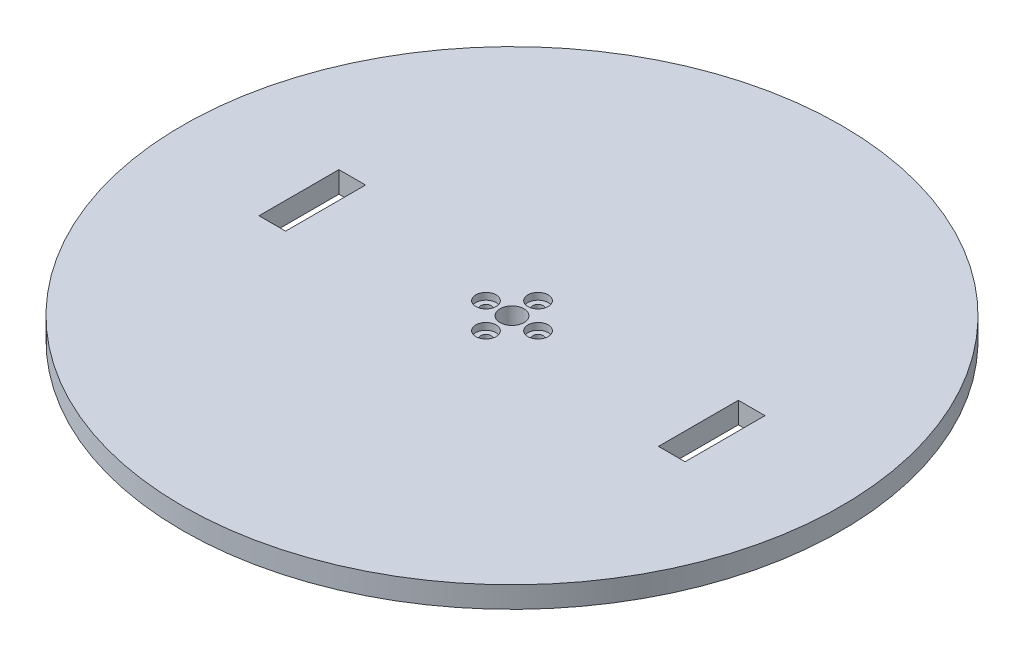
ISO-10303-21;
HEADER;
FILE_DESCRIPTION(('STEP AP214'),'2;1');
FILE_NAME('part.step','',(''),(''),'','','');
FILE_SCHEMA(('AUTOMOTIVE_DESIGN { 1 0 10303 214 1 1 1 1 }'));
ENDSEC;
DATA;
#1=APPLICATION_CONTEXT('core data for automotive mechanical design processes');
#2=APPLICATION_PROTOCOL_DEFINITION('international standard','automotive_design',2000,#1);
#3=PRODUCT_CONTEXT('',#1,'mechanical');
#4=PRODUCT('Part','Part','',(#3));
#5=PRODUCT_RELATED_PRODUCT_CATEGORY('part','',(#4));
#6=PRODUCT_DEFINITION_FORMATION('','',#4);
#7=PRODUCT_DEFINITION_CONTEXT('part definition',#1,'design');
#8=PRODUCT_DEFINITION('design','',#6,#7);
#9=PRODUCT_DEFINITION_SHAPE('','',#8);
#10=(LENGTH_UNIT() NAMED_UNIT(*) SI_UNIT(.MILLI.,.METRE.));
#11=(NAMED_UNIT(*) PLANE_ANGLE_UNIT() SI_UNIT($,.RADIAN.));
#12=(NAMED_UNIT(*) SI_UNIT($,.STERADIAN.) SOLID_ANGLE_UNIT());
#13=UNCERTAINTY_MEASURE_WITH_UNIT(LENGTH_MEASURE(1.E-05),#10,'distance_accuracy_value','');
#14=(GEOMETRIC_REPRESENTATION_CONTEXT(3) GLOBAL_UNCERTAINTY_ASSIGNED_CONTEXT((#13)) GLOBAL_UNIT_ASSIGNED_CONTEXT((#10,
#11,#12)) REPRESENTATION_CONTEXT('',''));
#15=CARTESIAN_POINT('',(0.,0.,0.));
#16=DIRECTION('',(0.,0.,1.));
#17=DIRECTION('',(1.,0.,0.));
#18=AXIS2_PLACEMENT_3D('',#15,#16,#17);
#19=CARTESIAN_POINT('',(-9.779,0.,-1.02429588037641E-13));
#20=DIRECTION('',(0.,1.,0.));
#21=DIRECTION('',(0.,0.,1.));
#22=AXIS2_PLACEMENT_3D('',#19,#20,#21);
#23=CYLINDRICAL_SURFACE('',#22,1.905);
#24=CARTESIAN_POINT('',(-9.779,0.,-1.02429588037641E-13));
#25=DIRECTION('',(0.,1.,0.));
#26=DIRECTION('',(1.,0.,0.));
#27=AXIS2_PLACEMENT_3D('',#24,#25,#26);
#28=CIRCLE('',#27,1.905);
#29=CARTESIAN_POINT('',(-7.874,0.,0.));
#30=VERTEX_POINT('',#29);
#31=EDGE_CURVE('E240',#30,#30,#28,.T.);
#32=ORIENTED_EDGE('',*,*,#31,.F.);
#33=EDGE_LOOP('',(#32));
#34=FACE_BOUND('',#33,.T.);
#35=CARTESIAN_POINT('',(-9.779,5.46,-1.02429588037641E-13));
#36=DIRECTION('',(0.,1.,0.));
#37=DIRECTION('',(0.,0.,1.));
#38=AXIS2_PLACEMENT_3D('',#35,#36,#37);
#39=CIRCLE('',#38,1.905);
#40=CARTESIAN_POINT('',(-9.779,5.46,1.9049999999999));
#41=VERTEX_POINT('',#40);
#42=EDGE_CURVE('E45',#41,#41,#39,.F.);
#43=ORIENTED_EDGE('',*,*,#42,.F.);
#44=EDGE_LOOP('',(#43));
#45=FACE_BOUND('',#44,.T.);
#46=ADVANCED_FACE('F41',(#34,#45),#23,.F.);
#47=CARTESIAN_POINT('',(0.,0.,9.779));
#48=DIRECTION('',(0.,1.,0.));
#49=DIRECTION('',(0.,0.,1.));
#50=AXIS2_PLACEMENT_3D('',#47,#48,#49);
#51=CYLINDRICAL_SURFACE('',#50,1.905);
#52=CARTESIAN_POINT('',(0.,0.,9.779));
#53=DIRECTION('',(0.,1.,0.));
#54=DIRECTION('',(0.,0.,-1.));
#55=AXIS2_PLACEMENT_3D('',#52,#53,#54);
#56=CIRCLE('',#55,1.905);
#57=CARTESIAN_POINT('',(0.,0.,7.874));
#58=VERTEX_POINT('',#57);
#59=EDGE_CURVE('E250',#58,#58,#56,.T.);
#60=ORIENTED_EDGE('',*,*,#59,.F.);
#61=EDGE_LOOP('',(#60));
#62=FACE_BOUND('',#61,.T.);
#63=CARTESIAN_POINT('',(0.,5.46,9.779));
#64=DIRECTION('',(0.,1.,0.));
#65=DIRECTION('',(0.,0.,1.));
#66=AXIS2_PLACEMENT_3D('',#63,#64,#65);
#67=CIRCLE('',#66,1.905);
#68=CARTESIAN_POINT('',(0.,5.46,11.684));
#69=VERTEX_POINT('',#68);
#70=EDGE_CURVE('E268',#69,#69,#67,.F.);
#71=ORIENTED_EDGE('',*,*,#70,.F.);
#72=EDGE_LOOP('',(#71));
#73=FACE_BOUND('',#72,.T.);
#74=ADVANCED_FACE('F280',(#62,#73),#51,.F.);
#75=CARTESIAN_POINT('',(9.779,0.,0.));
#76=DIRECTION('',(0.,1.,0.));
#77=DIRECTION('',(0.,0.,1.));
#78=AXIS2_PLACEMENT_3D('',#75,#76,#77);
#79=CYLINDRICAL_SURFACE('',#78,1.905);
#80=CARTESIAN_POINT('',(9.779,0.,0.));
#81=DIRECTION('',(0.,1.,0.));
#82=DIRECTION('',(-1.,0.,0.));
#83=AXIS2_PLACEMENT_3D('',#80,#81,#82);
#84=CIRCLE('',#83,1.905);
#85=CARTESIAN_POINT('',(7.874,0.,0.));
#86=VERTEX_POINT('',#85);
#87=EDGE_CURVE('E245',#86,#86,#84,.T.);
#88=ORIENTED_EDGE('',*,*,#87,.F.);
#89=EDGE_LOOP('',(#88));
#90=FACE_BOUND('',#89,.T.);
#91=CARTESIAN_POINT('',(9.779,5.46,0.));
#92=DIRECTION('',(0.,1.,0.));
#93=DIRECTION('',(0.,0.,1.));
#94=AXIS2_PLACEMENT_3D('',#91,#92,#93);
#95=CIRCLE('',#94,1.905);
#96=CARTESIAN_POINT('',(9.779,5.46,1.90500000000003));
#97=VERTEX_POINT('',#96);
#98=EDGE_CURVE('E207',#97,#97,#95,.F.);
#99=ORIENTED_EDGE('',*,*,#98,.F.);
#100=EDGE_LOOP('',(#99));
#101=FACE_BOUND('',#100,.T.);
#102=ADVANCED_FACE('F286',(#90,#101),#79,.F.);
#103=CARTESIAN_POINT('',(0.,0.,-9.779));
#104=DIRECTION('',(0.,1.,0.));
#105=DIRECTION('',(0.,0.,1.));
#106=AXIS2_PLACEMENT_3D('',#103,#104,#105);
#107=CYLINDRICAL_SURFACE('',#106,1.905);
#108=CARTESIAN_POINT('',(0.,0.,-9.779));
#109=DIRECTION('',(0.,1.,0.));
#110=DIRECTION('',(0.,0.,1.));
#111=AXIS2_PLACEMENT_3D('',#108,#109,#110);
#112=CIRCLE('',#111,1.905);
#113=CARTESIAN_POINT('',(0.,0.,-7.874));
#114=VERTEX_POINT('',#113);
#115=EDGE_CURVE('E249',#114,#114,#112,.T.);
#116=ORIENTED_EDGE('',*,*,#115,.F.);
#117=EDGE_LOOP('',(#116));
#118=FACE_BOUND('',#117,.T.);
#119=CARTESIAN_POINT('',(0.,5.46,-9.779));
#120=DIRECTION('',(0.,1.,0.));
#121=DIRECTION('',(0.,0.,1.));
#122=AXIS2_PLACEMENT_3D('',#119,#120,#121);
#123=CIRCLE('',#122,1.905);
#124=CARTESIAN_POINT('',(0.,5.46,-7.874));
#125=VERTEX_POINT('',#124);
#126=EDGE_CURVE('E231',#125,#125,#123,.F.);
#127=ORIENTED_EDGE('',*,*,#126,.F.);
#128=EDGE_LOOP('',(#127));
#129=FACE_BOUND('',#128,.T.);
#130=ADVANCED_FACE('F292',(#118,#129),#107,.F.);
#131=CARTESIAN_POINT('',(0.,8.,0.));
#132=DIRECTION('',(0.,-1.,0.));
#133=DIRECTION('',(0.,0.,-1.));
#134=AXIS2_PLACEMENT_3D('',#131,#132,#133);
#135=CYLINDRICAL_SURFACE('',#134,123.75);
#136=CARTESIAN_POINT('',(0.,8.,0.));
#137=DIRECTION('',(0.,1.,0.));
#138=DIRECTION('',(0.,0.,1.));
#139=AXIS2_PLACEMENT_3D('',#136,#137,#138);
#140=CIRCLE('',#139,123.75);
#141=CARTESIAN_POINT('',(0.,8.,123.75));
#142=VERTEX_POINT('',#141);
#143=EDGE_CURVE('E11',#142,#142,#140,.T.);
#144=ORIENTED_EDGE('',*,*,#143,.F.);
#145=EDGE_LOOP('',(#144));
#146=FACE_BOUND('',#145,.T.);
#147=CARTESIAN_POINT('',(0.,0.,0.));
#148=DIRECTION('',(0.,1.,0.));
#149=DIRECTION('',(0.,0.,1.));
#150=AXIS2_PLACEMENT_3D('',#147,#148,#149);
#151=CIRCLE('',#150,123.75);
#152=CARTESIAN_POINT('',(0.,0.,123.75));
#153=VERTEX_POINT('',#152);
#154=EDGE_CURVE('E51',#153,#153,#151,.T.);
#155=ORIENTED_EDGE('',*,*,#154,.T.);
#156=EDGE_LOOP('',(#155));
#157=FACE_BOUND('',#156,.T.);
#158=ADVANCED_FACE('F43',(#146,#157),#135,.T.);
#159=CARTESIAN_POINT('',(0.,8.,0.));
#160=DIRECTION('',(0.,1.,0.));
#161=DIRECTION('',(0.,0.,1.));
#162=AXIS2_PLACEMENT_3D('',#159,#160,#161);
#163=PLANE('',#162);
#164=DIRECTION('',(0.,0.,-1.));
#165=VECTOR('',#164,1.);
#166=CARTESIAN_POINT('',(80.,8.,15.));
#167=LINE('',#166,#165);
#168=CARTESIAN_POINT('',(80.,8.,15.));
#169=VERTEX_POINT('',#168);
#170=CARTESIAN_POINT('',(80.,8.,-15.));
#171=VERTEX_POINT('',#170);
#172=EDGE_CURVE('E59',#169,#171,#167,.T.);
#173=ORIENTED_EDGE('',*,*,#172,.F.);
#174=DIRECTION('',(1.,0.,0.));
#175=VECTOR('',#174,1.);
#176=CARTESIAN_POINT('',(80.,8.,15.));
#177=LINE('',#176,#175);
#178=CARTESIAN_POINT('',(70.,8.,15.));
#179=VERTEX_POINT('',#178);
#180=EDGE_CURVE('E133',#179,#169,#177,.T.);
#181=ORIENTED_EDGE('',*,*,#180,.F.);
#182=DIRECTION('',(0.,0.,1.));
#183=VECTOR('',#182,1.);
#184=CARTESIAN_POINT('',(70.,8.,15.));
#185=LINE('',#184,#183);
#186=CARTESIAN_POINT('',(70.,8.,-15.));
#187=VERTEX_POINT('',#186);
#188=EDGE_CURVE('E137',#187,#179,#185,.T.);
#189=ORIENTED_EDGE('',*,*,#188,.F.);
#190=DIRECTION('',(-1.,0.,0.));
#191=VECTOR('',#190,1.);
#192=CARTESIAN_POINT('',(80.,8.,-15.));
#193=LINE('',#192,#191);
#194=EDGE_CURVE('E146',#171,#187,#193,.T.);
#195=ORIENTED_EDGE('',*,*,#194,.F.);
#196=EDGE_LOOP('',(#173,#181,#189,#195));
#197=FACE_BOUND('',#196,.T.);
#198=DIRECTION('',(0.,0.,1.));
#199=VECTOR('',#198,1.);
#200=CARTESIAN_POINT('',(-80.,8.,15.));
#201=LINE('',#200,#199);
#202=CARTESIAN_POINT('',(-80.,8.,-15.));
#203=VERTEX_POINT('',#202);
#204=CARTESIAN_POINT('',(-80.,8.,15.));
#205=VERTEX_POINT('',#204);
#206=EDGE_CURVE('E67',#203,#205,#201,.T.);
#207=ORIENTED_EDGE('',*,*,#206,.F.);
#208=DIRECTION('',(-1.,0.,0.));
#209=VECTOR('',#208,1.);
#210=CARTESIAN_POINT('',(-80.,8.,-15.));
#211=LINE('',#210,#209);
#212=CARTESIAN_POINT('',(-70.,8.,-15.));
#213=VERTEX_POINT('',#212);
#214=EDGE_CURVE('E167',#213,#203,#211,.T.);
#215=ORIENTED_EDGE('',*,*,#214,.F.);
#216=DIRECTION('',(0.,0.,-1.));
#217=VECTOR('',#216,1.);
#218=CARTESIAN_POINT('',(-70.,8.,15.));
#219=LINE('',#218,#217);
#220=CARTESIAN_POINT('',(-70.,8.,15.));
#221=VERTEX_POINT('',#220);
#222=EDGE_CURVE('E186',#221,#213,#219,.T.);
#223=ORIENTED_EDGE('',*,*,#222,.F.);
#224=DIRECTION('',(1.,0.,0.));
#225=VECTOR('',#224,1.);
#226=CARTESIAN_POINT('',(-80.,8.,15.));
#227=LINE('',#226,#225);
#228=EDGE_CURVE('E182',#205,#221,#227,.T.);
#229=ORIENTED_EDGE('',*,*,#228,.F.);
#230=EDGE_LOOP('',(#207,#215,#223,#229));
#231=FACE_BOUND('',#230,.T.);
#232=CARTESIAN_POINT('',(9.779,8.,0.));
#233=DIRECTION('',(0.,1.,0.));
#234=DIRECTION('',(-1.,0.,0.));
#235=AXIS2_PLACEMENT_3D('',#232,#233,#234);
#236=CIRCLE('',#235,3.81);
#237=CARTESIAN_POINT('',(5.969,8.,0.));
#238=VERTEX_POINT('',#237);
#239=EDGE_CURVE('E208',#238,#238,#236,.T.);
#240=ORIENTED_EDGE('',*,*,#239,.F.);
#241=EDGE_LOOP('',(#240));
#242=FACE_BOUND('',#241,.T.);
#243=CARTESIAN_POINT('',(0.,8.,9.779));
#244=DIRECTION('',(0.,1.,0.));
#245=DIRECTION('',(0.,0.,-1.));
#246=AXIS2_PLACEMENT_3D('',#243,#244,#245);
#247=CIRCLE('',#246,3.81);
#248=CARTESIAN_POINT('',(0.,8.,5.969));
#249=VERTEX_POINT('',#248);
#250=EDGE_CURVE('E216',#249,#249,#247,.T.);
#251=ORIENTED_EDGE('',*,*,#250,.F.);
#252=EDGE_LOOP('',(#251));
#253=FACE_BOUND('',#252,.T.);
#254=CARTESIAN_POINT('',(-9.779,8.,-1.02429588037641E-13));
#255=DIRECTION('',(0.,1.,0.));
#256=DIRECTION('',(1.,0.,0.));
#257=AXIS2_PLACEMENT_3D('',#254,#255,#256);
#258=CIRCLE('',#257,3.81);
#259=CARTESIAN_POINT('',(-5.969,8.,0.));
#260=VERTEX_POINT('',#259);
#261=EDGE_CURVE('E156',#260,#260,#258,.T.);
#262=ORIENTED_EDGE('',*,*,#261,.F.);
#263=EDGE_LOOP('',(#262));
#264=FACE_BOUND('',#263,.T.);
#265=CARTESIAN_POINT('',(0.,8.,-9.779));
#266=DIRECTION('',(0.,1.,0.));
#267=DIRECTION('',(0.,0.,1.));
#268=AXIS2_PLACEMENT_3D('',#265,#266,#267);
#269=CIRCLE('',#268,3.81);
#270=CARTESIAN_POINT('',(0.,8.,-5.969));
#271=VERTEX_POINT('',#270);
#272=EDGE_CURVE('E232',#271,#271,#269,.T.);
#273=ORIENTED_EDGE('',*,*,#272,.F.);
#274=EDGE_LOOP('',(#273));
#275=FACE_BOUND('',#274,.T.);
#276=CARTESIAN_POINT('',(0.,8.,0.));
#277=DIRECTION('',(0.,1.,0.));
#278=DIRECTION('',(0.,0.,1.));
#279=AXIS2_PLACEMENT_3D('',#276,#277,#278);
#280=CIRCLE('',#279,4.5);
#281=CARTESIAN_POINT('',(0.,8.,4.5));
#282=VERTEX_POINT('',#281);
#283=EDGE_CURVE('E241',#282,#282,#280,.T.);
#284=ORIENTED_EDGE('',*,*,#283,.F.);
#285=EDGE_LOOP('',(#284));
#286=FACE_BOUND('',#285,.T.);
#287=ORIENTED_EDGE('',*,*,#143,.T.);
#288=EDGE_LOOP('',(#287));
#289=FACE_BOUND('',#288,.T.);
#290=ADVANCED_FACE('F296',(#197,#231,#242,#253,#264,#275,#286,#289),#163,.T.);
#291=CARTESIAN_POINT('',(0.,0.,0.));
#292=DIRECTION('',(0.,1.,0.));
#293=DIRECTION('',(0.,0.,1.));
#294=AXIS2_PLACEMENT_3D('',#291,#292,#293);
#295=PLANE('',#294);
#296=DIRECTION('',(1.,0.,0.));
#297=VECTOR('',#296,1.);
#298=CARTESIAN_POINT('',(80.,0.,15.));
#299=LINE('',#298,#297);
#300=CARTESIAN_POINT('',(70.,0.,15.));
#301=VERTEX_POINT('',#300);
#302=CARTESIAN_POINT('',(80.,0.,15.));
#303=VERTEX_POINT('',#302);
#304=EDGE_CURVE('E118',#301,#303,#299,.T.);
#305=ORIENTED_EDGE('',*,*,#304,.T.);
#306=DIRECTION('',(0.,0.,-1.));
#307=VECTOR('',#306,1.);
#308=CARTESIAN_POINT('',(80.,0.,15.));
#309=LINE('',#308,#307);
#310=CARTESIAN_POINT('',(80.,0.,-15.));
#311=VERTEX_POINT('',#310);
#312=EDGE_CURVE('E111',#303,#311,#309,.T.);
#313=ORIENTED_EDGE('',*,*,#312,.T.);
#314=DIRECTION('',(-1.,0.,0.));
#315=VECTOR('',#314,1.);
#316=CARTESIAN_POINT('',(80.,0.,-15.));
#317=LINE('',#316,#315);
#318=CARTESIAN_POINT('',(70.,0.,-15.));
#319=VERTEX_POINT('',#318);
#320=EDGE_CURVE('E122',#311,#319,#317,.T.);
#321=ORIENTED_EDGE('',*,*,#320,.T.);
#322=DIRECTION('',(0.,0.,1.));
#323=VECTOR('',#322,1.);
#324=CARTESIAN_POINT('',(70.,0.,15.));
#325=LINE('',#324,#323);
#326=EDGE_CURVE('E127',#319,#301,#325,.T.);
#327=ORIENTED_EDGE('',*,*,#326,.T.);
#328=EDGE_LOOP('',(#305,#313,#321,#327));
#329=FACE_BOUND('',#328,.T.);
#330=DIRECTION('',(-1.,0.,0.));
#331=VECTOR('',#330,1.);
#332=CARTESIAN_POINT('',(-80.,0.,-15.));
#333=LINE('',#332,#331);
#334=CARTESIAN_POINT('',(-70.,0.,-15.));
#335=VERTEX_POINT('',#334);
#336=CARTESIAN_POINT('',(-80.,0.,-15.));
#337=VERTEX_POINT('',#336);
#338=EDGE_CURVE('E175',#335,#337,#333,.T.);
#339=ORIENTED_EDGE('',*,*,#338,.T.);
#340=DIRECTION('',(0.,0.,1.));
#341=VECTOR('',#340,1.);
#342=CARTESIAN_POINT('',(-80.,0.,15.));
#343=LINE('',#342,#341);
#344=CARTESIAN_POINT('',(-80.,0.,15.));
#345=VERTEX_POINT('',#344);
#346=EDGE_CURVE('E162',#337,#345,#343,.T.);
#347=ORIENTED_EDGE('',*,*,#346,.T.);
#348=DIRECTION('',(1.,0.,0.));
#349=VECTOR('',#348,1.);
#350=CARTESIAN_POINT('',(-80.,0.,15.));
#351=LINE('',#350,#349);
#352=CARTESIAN_POINT('',(-70.,0.,15.));
#353=VERTEX_POINT('',#352);
#354=EDGE_CURVE('E166',#345,#353,#351,.T.);
#355=ORIENTED_EDGE('',*,*,#354,.T.);
#356=DIRECTION('',(0.,0.,-1.));
#357=VECTOR('',#356,1.);
#358=CARTESIAN_POINT('',(-70.,0.,15.));
#359=LINE('',#358,#357);
#360=EDGE_CURVE('E171',#353,#335,#359,.T.);
#361=ORIENTED_EDGE('',*,*,#360,.T.);
#362=EDGE_LOOP('',(#339,#347,#355,#361));
#363=FACE_BOUND('',#362,.T.);
#364=CARTESIAN_POINT('',(0.,0.,0.));
#365=DIRECTION('',(0.,1.,0.));
#366=DIRECTION('',(0.,0.,1.));
#367=AXIS2_PLACEMENT_3D('',#364,#365,#366);
#368=CIRCLE('',#367,4.5);
#369=CARTESIAN_POINT('',(0.,0.,4.5));
#370=VERTEX_POINT('',#369);
#371=EDGE_CURVE('E236',#370,#370,#368,.T.);
#372=ORIENTED_EDGE('',*,*,#371,.T.);
#373=EDGE_LOOP('',(#372));
#374=FACE_BOUND('',#373,.T.);
#375=ORIENTED_EDGE('',*,*,#87,.T.);
#376=EDGE_LOOP('',(#375));
#377=FACE_BOUND('',#376,.T.);
#378=ORIENTED_EDGE('',*,*,#59,.T.);
#379=EDGE_LOOP('',(#378));
#380=FACE_BOUND('',#379,.T.);
#381=ORIENTED_EDGE('',*,*,#31,.T.);
#382=EDGE_LOOP('',(#381));
#383=FACE_BOUND('',#382,.T.);
#384=ORIENTED_EDGE('',*,*,#115,.T.);
#385=EDGE_LOOP('',(#384));
#386=FACE_BOUND('',#385,.T.);
#387=ORIENTED_EDGE('',*,*,#154,.F.);
#388=EDGE_LOOP('',(#387));
#389=FACE_BOUND('',#388,.T.);
#390=ADVANCED_FACE('F129',(#329,#363,#374,#377,#380,#383,#386,#389),#295,.F.);
#391=CARTESIAN_POINT('',(0.,0.,0.));
#392=DIRECTION('',(0.,1.,0.));
#393=DIRECTION('',(0.,0.,1.));
#394=AXIS2_PLACEMENT_3D('',#391,#392,#393);
#395=CYLINDRICAL_SURFACE('',#394,4.5);
#396=ORIENTED_EDGE('',*,*,#371,.F.);
#397=EDGE_LOOP('',(#396));
#398=FACE_BOUND('',#397,.T.);
#399=ORIENTED_EDGE('',*,*,#283,.T.);
#400=EDGE_LOOP('',(#399));
#401=FACE_BOUND('',#400,.T.);
#402=ADVANCED_FACE('F300',(#398,#401),#395,.F.);
#403=CARTESIAN_POINT('',(0.,5.46,-9.779));
#404=DIRECTION('',(0.,1.,0.));
#405=DIRECTION('',(0.,0.,1.));
#406=AXIS2_PLACEMENT_3D('',#403,#404,#405);
#407=PLANE('',#406);
#408=CARTESIAN_POINT('',(0.,5.46,-9.779));
#409=DIRECTION('',(0.,1.,0.));
#410=DIRECTION('',(0.,0.,1.));
#411=AXIS2_PLACEMENT_3D('',#408,#409,#410);
#412=CIRCLE('',#411,3.81);
#413=CARTESIAN_POINT('',(0.,5.46,-5.969));
#414=VERTEX_POINT('',#413);
#415=EDGE_CURVE('E227',#414,#414,#412,.T.);
#416=ORIENTED_EDGE('',*,*,#415,.T.);
#417=EDGE_LOOP('',(#416));
#418=FACE_BOUND('',#417,.T.);
#419=ORIENTED_EDGE('',*,*,#126,.T.);
#420=EDGE_LOOP('',(#419));
#421=FACE_BOUND('',#420,.T.);
#422=ADVANCED_FACE('F304',(#418,#421),#407,.T.);
#423=CARTESIAN_POINT('',(0.,5.46,-9.779));
#424=DIRECTION('',(0.,1.,0.));
#425=DIRECTION('',(0.,0.,1.));
#426=AXIS2_PLACEMENT_3D('',#423,#424,#425);
#427=CYLINDRICAL_SURFACE('',#426,3.81);
#428=ORIENTED_EDGE('',*,*,#415,.F.);
#429=EDGE_LOOP('',(#428));
#430=FACE_BOUND('',#429,.T.);
#431=ORIENTED_EDGE('',*,*,#272,.T.);
#432=EDGE_LOOP('',(#431));
#433=FACE_BOUND('',#432,.T.);
#434=ADVANCED_FACE('F310',(#430,#433),#427,.F.);
#435=CARTESIAN_POINT('',(9.779,5.46,0.));
#436=DIRECTION('',(0.,1.,0.));
#437=DIRECTION('',(-1.,0.,0.));
#438=AXIS2_PLACEMENT_3D('',#435,#436,#437);
#439=PLANE('',#438);
#440=CARTESIAN_POINT('',(9.779,5.46,0.));
#441=DIRECTION('',(0.,1.,0.));
#442=DIRECTION('',(-1.,0.,0.));
#443=AXIS2_PLACEMENT_3D('',#440,#441,#442);
#444=CIRCLE('',#443,3.81);
#445=CARTESIAN_POINT('',(5.969,5.46,0.));
#446=VERTEX_POINT('',#445);
#447=EDGE_CURVE('E203',#446,#446,#444,.T.);
#448=ORIENTED_EDGE('',*,*,#447,.T.);
#449=EDGE_LOOP('',(#448));
#450=FACE_BOUND('',#449,.T.);
#451=ORIENTED_EDGE('',*,*,#98,.T.);
#452=EDGE_LOOP('',(#451));
#453=FACE_BOUND('',#452,.T.);
#454=ADVANCED_FACE('F324',(#450,#453),#439,.T.);
#455=CARTESIAN_POINT('',(9.779,5.46,0.));
#456=DIRECTION('',(0.,1.,0.));
#457=DIRECTION('',(0.,0.,1.));
#458=AXIS2_PLACEMENT_3D('',#455,#456,#457);
#459=CYLINDRICAL_SURFACE('',#458,3.81);
#460=ORIENTED_EDGE('',*,*,#447,.F.);
#461=EDGE_LOOP('',(#460));
#462=FACE_BOUND('',#461,.T.);
#463=ORIENTED_EDGE('',*,*,#239,.T.);
#464=EDGE_LOOP('',(#463));
#465=FACE_BOUND('',#464,.T.);
#466=ADVANCED_FACE('F326',(#462,#465),#459,.F.);
#467=CARTESIAN_POINT('',(0.,5.46,9.779));
#468=DIRECTION('',(0.,1.,0.));
#469=DIRECTION('',(0.,0.,-1.));
#470=AXIS2_PLACEMENT_3D('',#467,#468,#469);
#471=PLANE('',#470);
#472=CARTESIAN_POINT('',(0.,5.46,9.779));
#473=DIRECTION('',(0.,1.,0.));
#474=DIRECTION('',(0.,0.,-1.));
#475=AXIS2_PLACEMENT_3D('',#472,#473,#474);
#476=CIRCLE('',#475,3.81);
#477=CARTESIAN_POINT('',(0.,5.46,5.969));
#478=VERTEX_POINT('',#477);
#479=EDGE_CURVE('E212',#478,#478,#476,.T.);
#480=ORIENTED_EDGE('',*,*,#479,.T.);
#481=EDGE_LOOP('',(#480));
#482=FACE_BOUND('',#481,.T.);
#483=ORIENTED_EDGE('',*,*,#70,.T.);
#484=EDGE_LOOP('',(#483));
#485=FACE_BOUND('',#484,.T.);
#486=ADVANCED_FACE('F333',(#482,#485),#471,.T.);
#487=CARTESIAN_POINT('',(0.,5.46,9.779));
#488=DIRECTION('',(0.,1.,0.));
#489=DIRECTION('',(0.,0.,1.));
#490=AXIS2_PLACEMENT_3D('',#487,#488,#489);
#491=CYLINDRICAL_SURFACE('',#490,3.81);
#492=ORIENTED_EDGE('',*,*,#479,.F.);
#493=EDGE_LOOP('',(#492));
#494=FACE_BOUND('',#493,.T.);
#495=ORIENTED_EDGE('',*,*,#250,.T.);
#496=EDGE_LOOP('',(#495));
#497=FACE_BOUND('',#496,.T.);
#498=ADVANCED_FACE('F343',(#494,#497),#491,.F.);
#499=CARTESIAN_POINT('',(-9.779,5.46,-1.02429588037641E-13));
#500=DIRECTION('',(0.,1.,0.));
#501=DIRECTION('',(1.,0.,0.));
#502=AXIS2_PLACEMENT_3D('',#499,#500,#501);
#503=PLANE('',#502);
#504=CARTESIAN_POINT('',(-9.779,5.46,-1.02429588037641E-13));
#505=DIRECTION('',(0.,1.,0.));
#506=DIRECTION('',(1.,0.,0.));
#507=AXIS2_PLACEMENT_3D('',#504,#505,#506);
#508=CIRCLE('',#507,3.81);
#509=CARTESIAN_POINT('',(-5.969,5.46,0.));
#510=VERTEX_POINT('',#509);
#511=EDGE_CURVE('E220',#510,#510,#508,.T.);
#512=ORIENTED_EDGE('',*,*,#511,.T.);
#513=EDGE_LOOP('',(#512));
#514=FACE_BOUND('',#513,.T.);
#515=ORIENTED_EDGE('',*,*,#42,.T.);
#516=EDGE_LOOP('',(#515));
#517=FACE_BOUND('',#516,.T.);
#518=ADVANCED_FACE('F277',(#514,#517),#503,.T.);
#519=CARTESIAN_POINT('',(-9.779,5.46,-1.02429588037641E-13));
#520=DIRECTION('',(0.,1.,0.));
#521=DIRECTION('',(0.,0.,1.));
#522=AXIS2_PLACEMENT_3D('',#519,#520,#521);
#523=CYLINDRICAL_SURFACE('',#522,3.81);
#524=ORIENTED_EDGE('',*,*,#511,.F.);
#525=EDGE_LOOP('',(#524));
#526=FACE_BOUND('',#525,.T.);
#527=ORIENTED_EDGE('',*,*,#261,.T.);
#528=EDGE_LOOP('',(#527));
#529=FACE_BOUND('',#528,.T.);
#530=ADVANCED_FACE('F350',(#526,#529),#523,.F.);
#531=CARTESIAN_POINT('',(-80.,0.,15.));
#532=DIRECTION('',(-1.,0.,0.));
#533=DIRECTION('',(0.,0.,1.));
#534=AXIS2_PLACEMENT_3D('',#531,#532,#533);
#535=PLANE('',#534);
#536=ORIENTED_EDGE('',*,*,#206,.T.);
#537=DIRECTION('',(0.,1.,0.));
#538=VECTOR('',#537,1.);
#539=CARTESIAN_POINT('',(-80.,0.,15.));
#540=LINE('',#539,#538);
#541=EDGE_CURVE('E179',#345,#205,#540,.T.);
#542=ORIENTED_EDGE('',*,*,#541,.F.);
#543=ORIENTED_EDGE('',*,*,#346,.F.);
#544=DIRECTION('',(0.,1.,0.));
#545=VECTOR('',#544,1.);
#546=CARTESIAN_POINT('',(-80.,0.,-15.));
#547=LINE('',#546,#545);
#548=EDGE_CURVE('E147',#337,#203,#547,.T.);
#549=ORIENTED_EDGE('',*,*,#548,.T.);
#550=EDGE_LOOP('',(#536,#542,#543,#549));
#551=FACE_BOUND('',#550,.T.);
#552=ADVANCED_FACE('F338',(#551),#535,.F.);
#553=CARTESIAN_POINT('',(-80.,0.,-15.));
#554=DIRECTION('',(0.,0.,-1.));
#555=DIRECTION('',(-1.,0.,0.));
#556=AXIS2_PLACEMENT_3D('',#553,#554,#555);
#557=PLANE('',#556);
#558=ORIENTED_EDGE('',*,*,#214,.T.);
#559=ORIENTED_EDGE('',*,*,#548,.F.);
#560=ORIENTED_EDGE('',*,*,#338,.F.);
#561=DIRECTION('',(0.,1.,0.));
#562=VECTOR('',#561,1.);
#563=CARTESIAN_POINT('',(-70.,0.,-15.));
#564=LINE('',#563,#562);
#565=EDGE_CURVE('E195',#335,#213,#564,.T.);
#566=ORIENTED_EDGE('',*,*,#565,.T.);
#567=EDGE_LOOP('',(#558,#559,#560,#566));
#568=FACE_BOUND('',#567,.T.);
#569=ADVANCED_FACE('F357',(#568),#557,.F.);
#570=CARTESIAN_POINT('',(-70.,0.,15.));
#571=DIRECTION('',(1.,0.,0.));
#572=DIRECTION('',(0.,0.,-1.));
#573=AXIS2_PLACEMENT_3D('',#570,#571,#572);
#574=PLANE('',#573);
#575=ORIENTED_EDGE('',*,*,#222,.T.);
#576=ORIENTED_EDGE('',*,*,#565,.F.);
#577=ORIENTED_EDGE('',*,*,#360,.F.);
#578=DIRECTION('',(0.,1.,0.));
#579=VECTOR('',#578,1.);
#580=CARTESIAN_POINT('',(-70.,0.,15.));
#581=LINE('',#580,#579);
#582=EDGE_CURVE('E198',#353,#221,#581,.T.);
#583=ORIENTED_EDGE('',*,*,#582,.T.);
#584=EDGE_LOOP('',(#575,#576,#577,#583));
#585=FACE_BOUND('',#584,.T.);
#586=ADVANCED_FACE('F404',(#585),#574,.F.);
#587=CARTESIAN_POINT('',(-80.,0.,15.));
#588=DIRECTION('',(0.,0.,1.));
#589=DIRECTION('',(1.,0.,0.));
#590=AXIS2_PLACEMENT_3D('',#587,#588,#589);
#591=PLANE('',#590);
#592=ORIENTED_EDGE('',*,*,#228,.T.);
#593=ORIENTED_EDGE('',*,*,#582,.F.);
#594=ORIENTED_EDGE('',*,*,#354,.F.);
#595=ORIENTED_EDGE('',*,*,#541,.T.);
#596=EDGE_LOOP('',(#592,#593,#594,#595));
#597=FACE_BOUND('',#596,.T.);
#598=ADVANCED_FACE('F414',(#597),#591,.F.);
#599=CARTESIAN_POINT('',(80.,0.,15.));
#600=DIRECTION('',(1.,0.,0.));
#601=DIRECTION('',(0.,0.,-1.));
#602=AXIS2_PLACEMENT_3D('',#599,#600,#601);
#603=PLANE('',#602);
#604=ORIENTED_EDGE('',*,*,#172,.T.);
#605=DIRECTION('',(0.,1.,0.));
#606=VECTOR('',#605,1.);
#607=CARTESIAN_POINT('',(80.,0.,-15.));
#608=LINE('',#607,#606);
#609=EDGE_CURVE('E107',#311,#171,#608,.T.);
#610=ORIENTED_EDGE('',*,*,#609,.F.);
#611=ORIENTED_EDGE('',*,*,#312,.F.);
#612=DIRECTION('',(0.,1.,0.));
#613=VECTOR('',#612,1.);
#614=CARTESIAN_POINT('',(80.,0.,15.));
#615=LINE('',#614,#613);
#616=EDGE_CURVE('E153',#303,#169,#615,.T.);
#617=ORIENTED_EDGE('',*,*,#616,.T.);
#618=EDGE_LOOP('',(#604,#610,#611,#617));
#619=FACE_BOUND('',#618,.T.);
#620=ADVANCED_FACE('F109',(#619),#603,.F.);
#621=CARTESIAN_POINT('',(80.,0.,15.));
#622=DIRECTION('',(0.,0.,1.));
#623=DIRECTION('',(1.,0.,0.));
#624=AXIS2_PLACEMENT_3D('',#621,#622,#623);
#625=PLANE('',#624);
#626=ORIENTED_EDGE('',*,*,#180,.T.);
#627=ORIENTED_EDGE('',*,*,#616,.F.);
#628=ORIENTED_EDGE('',*,*,#304,.F.);
#629=DIRECTION('',(0.,1.,0.));
#630=VECTOR('',#629,1.);
#631=CARTESIAN_POINT('',(70.,0.,15.));
#632=LINE('',#631,#630);
#633=EDGE_CURVE('E157',#301,#179,#632,.T.);
#634=ORIENTED_EDGE('',*,*,#633,.T.);
#635=EDGE_LOOP('',(#626,#627,#628,#634));
#636=FACE_BOUND('',#635,.T.);
#637=ADVANCED_FACE('F432',(#636),#625,.F.);
#638=CARTESIAN_POINT('',(70.,0.,15.));
#639=DIRECTION('',(-1.,0.,0.));
#640=DIRECTION('',(0.,0.,1.));
#641=AXIS2_PLACEMENT_3D('',#638,#639,#640);
#642=PLANE('',#641);
#643=ORIENTED_EDGE('',*,*,#188,.T.);
#644=ORIENTED_EDGE('',*,*,#633,.F.);
#645=ORIENTED_EDGE('',*,*,#326,.F.);
#646=DIRECTION('',(0.,1.,0.));
#647=VECTOR('',#646,1.);
#648=CARTESIAN_POINT('',(70.,0.,-15.));
#649=LINE('',#648,#647);
#650=EDGE_CURVE('E117',#319,#187,#649,.T.);
#651=ORIENTED_EDGE('',*,*,#650,.T.);
#652=EDGE_LOOP('',(#643,#644,#645,#651));
#653=FACE_BOUND('',#652,.T.);
#654=ADVANCED_FACE('F441',(#653),#642,.F.);
#655=CARTESIAN_POINT('',(80.,0.,-15.));
#656=DIRECTION('',(0.,0.,-1.));
#657=DIRECTION('',(-1.,0.,0.));
#658=AXIS2_PLACEMENT_3D('',#655,#656,#657);
#659=PLANE('',#658);
#660=ORIENTED_EDGE('',*,*,#194,.T.);
#661=ORIENTED_EDGE('',*,*,#650,.F.);
#662=ORIENTED_EDGE('',*,*,#320,.F.);
#663=ORIENTED_EDGE('',*,*,#609,.T.);
#664=EDGE_LOOP('',(#660,#661,#662,#663));
#665=FACE_BOUND('',#664,.T.);
#666=ADVANCED_FACE('F123',(#665),#659,.F.);
#667=CLOSED_SHELL('',(#46,#74,#102,#130,#158,#290,#390,#402,#422,#434,#454,#466,#486,#498,#518,
#530,#552,#569,#586,#598,#620,#637,#654,#666));
#668=MANIFOLD_SOLID_BREP('B2',#667);
#669=ADVANCED_BREP_SHAPE_REPRESENTATION('',(#18,#668),#14);
#670=SHAPE_DEFINITION_REPRESENTATION(#9,#669);
ENDSEC;
END-ISO-10303-21;
